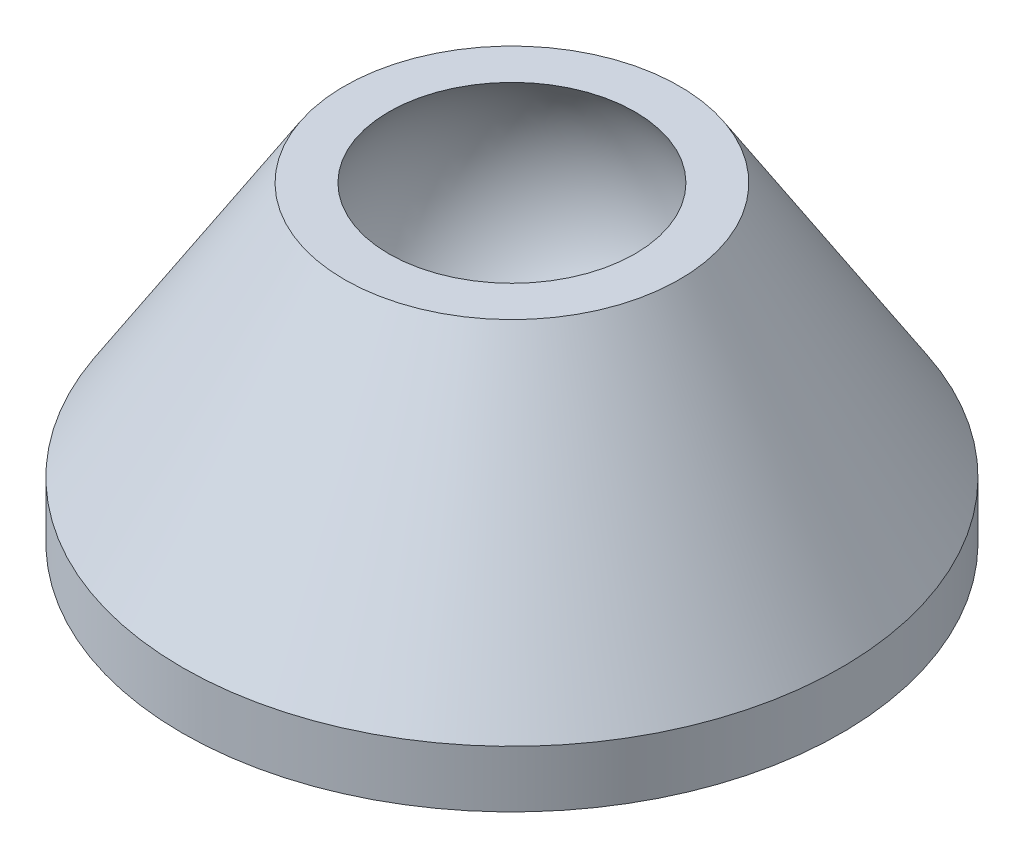
ISO-10303-21;
HEADER;
FILE_DESCRIPTION(('STEP AP214'),'2;1');
FILE_NAME('part.step','',(''),(''),'','','');
FILE_SCHEMA(('AUTOMOTIVE_DESIGN { 1 0 10303 214 1 1 1 1 }'));
ENDSEC;
DATA;
#1=APPLICATION_CONTEXT('core data for automotive mechanical design processes');
#2=APPLICATION_PROTOCOL_DEFINITION('international standard','automotive_design',2000,#1);
#3=PRODUCT_CONTEXT('',#1,'mechanical');
#4=PRODUCT('Part','Part','',(#3));
#5=PRODUCT_RELATED_PRODUCT_CATEGORY('part','',(#4));
#6=PRODUCT_DEFINITION_FORMATION('','',#4);
#7=PRODUCT_DEFINITION_CONTEXT('part definition',#1,'design');
#8=PRODUCT_DEFINITION('design','',#6,#7);
#9=PRODUCT_DEFINITION_SHAPE('','',#8);
#10=(LENGTH_UNIT() NAMED_UNIT(*) SI_UNIT(.MILLI.,.METRE.));
#11=(NAMED_UNIT(*) PLANE_ANGLE_UNIT() SI_UNIT($,.RADIAN.));
#12=(NAMED_UNIT(*) SI_UNIT($,.STERADIAN.) SOLID_ANGLE_UNIT());
#13=UNCERTAINTY_MEASURE_WITH_UNIT(LENGTH_MEASURE(1.E-05),#10,'distance_accuracy_value','');
#14=(GEOMETRIC_REPRESENTATION_CONTEXT(3) GLOBAL_UNCERTAINTY_ASSIGNED_CONTEXT((#13)) GLOBAL_UNIT_ASSIGNED_CONTEXT((#10,
#11,#12)) REPRESENTATION_CONTEXT('',''));
#15=CARTESIAN_POINT('',(0.,0.,0.));
#16=DIRECTION('',(0.,0.,1.));
#17=DIRECTION('',(1.,0.,0.));
#18=AXIS2_PLACEMENT_3D('',#15,#16,#17);
#19=CARTESIAN_POINT('',(0.,0.,0.));
#20=DIRECTION('',(0.,1.,0.));
#21=DIRECTION('',(1.,0.,0.));
#22=AXIS2_PLACEMENT_3D('',#19,#20,#21);
#23=SPHERICAL_SURFACE('',#22,6.);
#24=CARTESIAN_POINT('',(0.,3.67536375691526,0.));
#25=DIRECTION('',(0.,1.,0.));
#26=DIRECTION('',(0.,0.,1.));
#27=AXIS2_PLACEMENT_3D('',#24,#25,#26);
#28=CIRCLE('',#27,4.74254164497833);
#29=CARTESIAN_POINT('',(0.,3.67536375691526,4.74254164497833));
#30=VERTEX_POINT('',#29);
#31=EDGE_CURVE('E59',#30,#30,#28,.T.);
#32=ORIENTED_EDGE('',*,*,#31,.T.);
#33=EDGE_LOOP('',(#32));
#34=FACE_BOUND('',#33,.T.);
#35=ADVANCED_FACE('F34',(#34),#23,.F.);
#36=CARTESIAN_POINT('',(0.,-9.0594019871304,0.));
#37=DIRECTION('',(0.,-1.,0.));
#38=DIRECTION('',(0.,0.,-1.));
#39=AXIS2_PLACEMENT_3D('',#36,#37,#38);
#40=PLANE('',#39);
#41=CARTESIAN_POINT('',(0.,-9.0594019871304,0.));
#42=DIRECTION('',(0.,1.,0.));
#43=DIRECTION('',(0.,0.,1.));
#44=AXIS2_PLACEMENT_3D('',#41,#42,#43);
#45=CIRCLE('',#44,11.244226909272);
#46=CARTESIAN_POINT('',(0.,-9.0594019871304,11.244226909272));
#47=VERTEX_POINT('',#46);
#48=EDGE_CURVE('E10',#47,#47,#45,.T.);
#49=ORIENTED_EDGE('',*,*,#48,.F.);
#50=EDGE_LOOP('',(#49));
#51=FACE_BOUND('',#50,.T.);
#52=ADVANCED_FACE('F82',(#51),#40,.T.);
#53=CARTESIAN_POINT('',(0.,-8.5594019871304,0.));
#54=DIRECTION('',(0.,1.,0.));
#55=DIRECTION('',(0.,0.,1.));
#56=AXIS2_PLACEMENT_3D('',#53,#54,#55);
#57=TOROIDAL_SURFACE('',#56,11.244226909272,0.5);
#58=ORIENTED_EDGE('',*,*,#48,.T.);
#59=EDGE_LOOP('',(#58));
#60=FACE_BOUND('',#59,.T.);
#61=CARTESIAN_POINT('',(0.,-8.5594019871304,0.));
#62=DIRECTION('',(0.,1.,0.));
#63=DIRECTION('',(0.,0.,1.));
#64=AXIS2_PLACEMENT_3D('',#61,#62,#63);
#65=CIRCLE('',#64,11.744226909272);
#66=CARTESIAN_POINT('',(0.,-8.5594019871304,11.744226909272));
#67=VERTEX_POINT('',#66);
#68=EDGE_CURVE('E40',#67,#67,#65,.T.);
#69=ORIENTED_EDGE('',*,*,#68,.F.);
#70=EDGE_LOOP('',(#69));
#71=FACE_BOUND('',#70,.T.);
#72=ADVANCED_FACE('F86',(#60,#71),#57,.T.);
#73=CARTESIAN_POINT('',(0.,0.,0.));
#74=DIRECTION('',(0.,1.,0.));
#75=DIRECTION('',(0.,0.,1.));
#76=AXIS2_PLACEMENT_3D('',#73,#74,#75);
#77=CYLINDRICAL_SURFACE('',#76,11.744226909272);
#78=ORIENTED_EDGE('',*,*,#68,.T.);
#79=EDGE_LOOP('',(#78));
#80=FACE_BOUND('',#79,.T.);
#81=CARTESIAN_POINT('',(0.,-8.34002662418243,0.));
#82=DIRECTION('',(0.,1.,0.));
#83=DIRECTION('',(0.,0.,1.));
#84=AXIS2_PLACEMENT_3D('',#81,#82,#83);
#85=CIRCLE('',#84,11.744226909272);
#86=CARTESIAN_POINT('',(0.,-8.34002662418243,11.744226909272));
#87=VERTEX_POINT('',#86);
#88=EDGE_CURVE('E44',#87,#87,#85,.T.);
#89=ORIENTED_EDGE('',*,*,#88,.F.);
#90=EDGE_LOOP('',(#89));
#91=FACE_BOUND('',#90,.T.);
#92=ADVANCED_FACE('F91',(#80,#91),#77,.T.);
#93=CARTESIAN_POINT('',(0.,-8.34002662418243,0.));
#94=DIRECTION('',(0.,-1.,0.));
#95=DIRECTION('',(0.,0.,-1.));
#96=AXIS2_PLACEMENT_3D('',#93,#94,#95);
#97=PLANE('',#96);
#98=ORIENTED_EDGE('',*,*,#88,.T.);
#99=EDGE_LOOP('',(#98));
#100=FACE_BOUND('',#99,.T.);
#101=CARTESIAN_POINT('',(0.,-8.34002662418243,0.));
#102=DIRECTION('',(0.,1.,0.));
#103=DIRECTION('',(0.,0.,1.));
#104=AXIS2_PLACEMENT_3D('',#101,#102,#103);
#105=CIRCLE('',#104,12.7);
#106=CARTESIAN_POINT('',(0.,-8.34002662418243,12.7));
#107=VERTEX_POINT('',#106);
#108=EDGE_CURVE('E48',#107,#107,#105,.T.);
#109=ORIENTED_EDGE('',*,*,#108,.F.);
#110=EDGE_LOOP('',(#109));
#111=FACE_BOUND('',#110,.T.);
#112=ADVANCED_FACE('F78',(#100,#111),#97,.T.);
#113=CARTESIAN_POINT('',(0.,0.,0.));
#114=DIRECTION('',(0.,1.,0.));
#115=DIRECTION('',(0.,0.,1.));
#116=AXIS2_PLACEMENT_3D('',#113,#114,#115);
#117=CYLINDRICAL_SURFACE('',#116,12.7);
#118=ORIENTED_EDGE('',*,*,#108,.T.);
#119=EDGE_LOOP('',(#118));
#120=FACE_BOUND('',#119,.T.);
#121=CARTESIAN_POINT('',(0.,-6.15068517942063,0.));
#122=DIRECTION('',(0.,1.,0.));
#123=DIRECTION('',(0.,0.,1.));
#124=AXIS2_PLACEMENT_3D('',#121,#122,#123);
#125=CIRCLE('',#124,12.7);
#126=CARTESIAN_POINT('',(0.,-6.15068517942063,12.7));
#127=VERTEX_POINT('',#126);
#128=EDGE_CURVE('E53',#127,#127,#125,.T.);
#129=ORIENTED_EDGE('',*,*,#128,.F.);
#130=EDGE_LOOP('',(#129));
#131=FACE_BOUND('',#130,.T.);
#132=ADVANCED_FACE('F72',(#120,#131),#117,.T.);
#133=CARTESIAN_POINT('',(0.,3.67536375691526,0.));
#134=DIRECTION('',(0.,-1.,0.));
#135=DIRECTION('',(0.,0.,-1.));
#136=AXIS2_PLACEMENT_3D('',#133,#134,#135);
#137=CONICAL_SURFACE('',#136,6.45596492733347,0.566083894021842);
#138=ORIENTED_EDGE('',*,*,#128,.T.);
#139=EDGE_LOOP('',(#138));
#140=FACE_BOUND('',#139,.T.);
#141=CARTESIAN_POINT('',(0.,3.67536375691526,0.));
#142=DIRECTION('',(0.,1.,0.));
#143=DIRECTION('',(0.,0.,1.));
#144=AXIS2_PLACEMENT_3D('',#141,#142,#143);
#145=CIRCLE('',#144,6.45596492733347);
#146=CARTESIAN_POINT('',(0.,3.67536375691526,6.45596492733347));
#147=VERTEX_POINT('',#146);
#148=EDGE_CURVE('E56',#147,#147,#145,.T.);
#149=ORIENTED_EDGE('',*,*,#148,.F.);
#150=EDGE_LOOP('',(#149));
#151=FACE_BOUND('',#150,.T.);
#152=ADVANCED_FACE('F67',(#140,#151),#137,.T.);
#153=CARTESIAN_POINT('',(0.,3.67536375691526,0.));
#154=DIRECTION('',(0.,-1.,0.));
#155=DIRECTION('',(0.,0.,-1.));
#156=AXIS2_PLACEMENT_3D('',#153,#154,#155);
#157=PLANE('',#156);
#158=ORIENTED_EDGE('',*,*,#31,.F.);
#159=EDGE_LOOP('',(#158));
#160=FACE_BOUND('',#159,.T.);
#161=ORIENTED_EDGE('',*,*,#148,.T.);
#162=EDGE_LOOP('',(#161));
#163=FACE_BOUND('',#162,.T.);
#164=ADVANCED_FACE('F64',(#160,#163),#157,.F.);
#165=CLOSED_SHELL('',(#35,#52,#72,#92,#112,#132,#152,#164));
#166=MANIFOLD_SOLID_BREP('B2',#165);
#167=ADVANCED_BREP_SHAPE_REPRESENTATION('',(#18,#166),#14);
#168=SHAPE_DEFINITION_REPRESENTATION(#9,#167);
ENDSEC;
END-ISO-10303-21;
